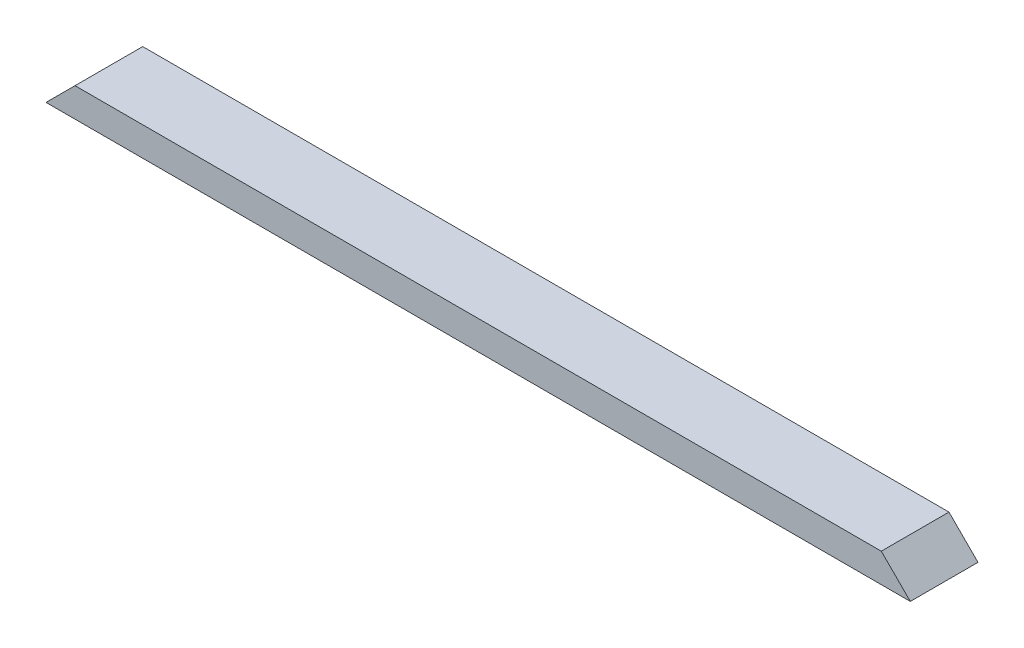
ISO-10303-21;
HEADER;
FILE_DESCRIPTION(('STEP AP214'),'2;1');
FILE_NAME('part.step','',(''),(''),'','','');
FILE_SCHEMA(('AUTOMOTIVE_DESIGN { 1 0 10303 214 1 1 1 1 }'));
ENDSEC;
DATA;
#1=APPLICATION_CONTEXT('core data for automotive mechanical design processes');
#2=APPLICATION_PROTOCOL_DEFINITION('international standard','automotive_design',2000,#1);
#3=PRODUCT_CONTEXT('',#1,'mechanical');
#4=PRODUCT('Part','Part','',(#3));
#5=PRODUCT_RELATED_PRODUCT_CATEGORY('part','',(#4));
#6=PRODUCT_DEFINITION_FORMATION('','',#4);
#7=PRODUCT_DEFINITION_CONTEXT('part definition',#1,'design');
#8=PRODUCT_DEFINITION('design','',#6,#7);
#9=PRODUCT_DEFINITION_SHAPE('','',#8);
#10=(LENGTH_UNIT() NAMED_UNIT(*) SI_UNIT(.MILLI.,.METRE.));
#11=(NAMED_UNIT(*) PLANE_ANGLE_UNIT() SI_UNIT($,.RADIAN.));
#12=(NAMED_UNIT(*) SI_UNIT($,.STERADIAN.) SOLID_ANGLE_UNIT());
#13=UNCERTAINTY_MEASURE_WITH_UNIT(LENGTH_MEASURE(1.E-05),#10,'distance_accuracy_value','');
#14=(GEOMETRIC_REPRESENTATION_CONTEXT(3) GLOBAL_UNCERTAINTY_ASSIGNED_CONTEXT((#13)) GLOBAL_UNIT_ASSIGNED_CONTEXT((#10,
#11,#12)) REPRESENTATION_CONTEXT('',''));
#15=CARTESIAN_POINT('',(0.,0.,0.));
#16=DIRECTION('',(0.,0.,1.));
#17=DIRECTION('',(1.,0.,0.));
#18=AXIS2_PLACEMENT_3D('',#15,#16,#17);
#19=CARTESIAN_POINT('',(0.,38.1,0.));
#20=DIRECTION('',(0.,0.,-1.));
#21=DIRECTION('',(-1.,0.,0.));
#22=AXIS2_PLACEMENT_3D('',#19,#20,#21);
#23=PLANE('',#22);
#24=DIRECTION('',(1.,0.,0.));
#25=VECTOR('',#24,1.);
#26=CARTESIAN_POINT('',(0.,38.1,0.));
#27=LINE('',#26,#25);
#28=CARTESIAN_POINT('',(38.1,38.1,0.));
#29=VERTEX_POINT('',#28);
#30=CARTESIAN_POINT('',(1096.9371,38.1,0.));
#31=VERTEX_POINT('',#30);
#32=EDGE_CURVE('E50',#29,#31,#27,.T.);
#33=ORIENTED_EDGE('',*,*,#32,.F.);
#34=DIRECTION('',(0.707106781186547,0.707106781186547,0.));
#35=VECTOR('',#34,1.);
#36=CARTESIAN_POINT('',(0.,0.,0.));
#37=LINE('',#36,#35);
#38=CARTESIAN_POINT('',(0.,0.,0.));
#39=VERTEX_POINT('',#38);
#40=EDGE_CURVE('E85',#39,#29,#37,.T.);
#41=ORIENTED_EDGE('',*,*,#40,.F.);
#42=DIRECTION('',(1.,0.,0.));
#43=VECTOR('',#42,1.);
#44=CARTESIAN_POINT('',(0.,0.,0.));
#45=LINE('',#44,#43);
#46=CARTESIAN_POINT('',(1135.0371,0.,0.));
#47=VERTEX_POINT('',#46);
#48=EDGE_CURVE('E91',#39,#47,#45,.T.);
#49=ORIENTED_EDGE('',*,*,#48,.T.);
#50=DIRECTION('',(0.707106781186548,-0.707106781186547,0.));
#51=VECTOR('',#50,1.);
#52=CARTESIAN_POINT('',(1096.9371,38.1,0.));
#53=LINE('',#52,#51);
#54=EDGE_CURVE('E66',#31,#47,#53,.T.);
#55=ORIENTED_EDGE('',*,*,#54,.F.);
#56=EDGE_LOOP('',(#33,#41,#49,#55));
#57=FACE_BOUND('',#56,.T.);
#58=ADVANCED_FACE('F41',(#57),#23,.F.);
#59=CARTESIAN_POINT('',(0.,38.1,-88.9));
#60=DIRECTION('',(0.,0.,1.));
#61=DIRECTION('',(1.,0.,0.));
#62=AXIS2_PLACEMENT_3D('',#59,#60,#61);
#63=PLANE('',#62);
#64=DIRECTION('',(-1.,0.,0.));
#65=VECTOR('',#64,1.);
#66=CARTESIAN_POINT('',(0.,0.,-88.9));
#67=LINE('',#66,#65);
#68=CARTESIAN_POINT('',(1135.0371,0.,-88.9));
#69=VERTEX_POINT('',#68);
#70=CARTESIAN_POINT('',(0.,0.,-88.9));
#71=VERTEX_POINT('',#70);
#72=EDGE_CURVE('E44',#69,#71,#67,.T.);
#73=ORIENTED_EDGE('',*,*,#72,.T.);
#74=DIRECTION('',(0.707106781186547,0.707106781186547,0.));
#75=VECTOR('',#74,1.);
#76=CARTESIAN_POINT('',(0.,0.,-88.9));
#77=LINE('',#76,#75);
#78=CARTESIAN_POINT('',(38.1,38.1,-88.9));
#79=VERTEX_POINT('',#78);
#80=EDGE_CURVE('E58',#71,#79,#77,.T.);
#81=ORIENTED_EDGE('',*,*,#80,.T.);
#82=DIRECTION('',(-1.,0.,0.));
#83=VECTOR('',#82,1.);
#84=CARTESIAN_POINT('',(0.,38.1,-88.9));
#85=LINE('',#84,#83);
#86=CARTESIAN_POINT('',(1096.9371,38.1,-88.9));
#87=VERTEX_POINT('',#86);
#88=EDGE_CURVE('E11',#87,#79,#85,.T.);
#89=ORIENTED_EDGE('',*,*,#88,.F.);
#90=DIRECTION('',(0.707106781186548,-0.707106781186547,0.));
#91=VECTOR('',#90,1.);
#92=CARTESIAN_POINT('',(1096.9371,38.1,-88.9));
#93=LINE('',#92,#91);
#94=EDGE_CURVE('E109',#87,#69,#93,.T.);
#95=ORIENTED_EDGE('',*,*,#94,.T.);
#96=EDGE_LOOP('',(#73,#81,#89,#95));
#97=FACE_BOUND('',#96,.T.);
#98=ADVANCED_FACE('F124',(#97),#63,.F.);
#99=CARTESIAN_POINT('',(0.,38.1,0.));
#100=DIRECTION('',(0.,-1.,0.));
#101=DIRECTION('',(0.,0.,-1.));
#102=AXIS2_PLACEMENT_3D('',#99,#100,#101);
#103=PLANE('',#102);
#104=ORIENTED_EDGE('',*,*,#88,.T.);
#105=DIRECTION('',(0.,0.,1.));
#106=VECTOR('',#105,1.);
#107=CARTESIAN_POINT('',(38.1,38.1,-88.9));
#108=LINE('',#107,#106);
#109=EDGE_CURVE('E92',#79,#29,#108,.T.);
#110=ORIENTED_EDGE('',*,*,#109,.T.);
#111=ORIENTED_EDGE('',*,*,#32,.T.);
#112=DIRECTION('',(0.,0.,1.));
#113=VECTOR('',#112,1.);
#114=CARTESIAN_POINT('',(1096.9371,38.1,-88.9));
#115=LINE('',#114,#113);
#116=EDGE_CURVE('E113',#87,#31,#115,.T.);
#117=ORIENTED_EDGE('',*,*,#116,.F.);
#118=EDGE_LOOP('',(#104,#110,#111,#117));
#119=FACE_BOUND('',#118,.T.);
#120=ADVANCED_FACE('F127',(#119),#103,.F.);
#121=CARTESIAN_POINT('',(0.,0.,0.));
#122=DIRECTION('',(0.,-1.,0.));
#123=DIRECTION('',(0.,0.,-1.));
#124=AXIS2_PLACEMENT_3D('',#121,#122,#123);
#125=PLANE('',#124);
#126=DIRECTION('',(0.,0.,1.));
#127=VECTOR('',#126,1.);
#128=CARTESIAN_POINT('',(0.,0.,0.));
#129=LINE('',#128,#127);
#130=EDGE_CURVE('E82',#71,#39,#129,.T.);
#131=ORIENTED_EDGE('',*,*,#130,.F.);
#132=ORIENTED_EDGE('',*,*,#72,.F.);
#133=DIRECTION('',(0.,0.,-1.));
#134=VECTOR('',#133,1.);
#135=CARTESIAN_POINT('',(1135.0371,0.,0.));
#136=LINE('',#135,#134);
#137=EDGE_CURVE('E101',#47,#69,#136,.T.);
#138=ORIENTED_EDGE('',*,*,#137,.F.);
#139=ORIENTED_EDGE('',*,*,#48,.F.);
#140=EDGE_LOOP('',(#131,#132,#138,#139));
#141=FACE_BOUND('',#140,.T.);
#142=ADVANCED_FACE('F100',(#141),#125,.T.);
#143=CARTESIAN_POINT('',(1096.9371,38.1,-88.9));
#144=DIRECTION('',(-0.707106781186547,-0.707106781186548,0.));
#145=DIRECTION('',(0.707106781186548,-0.707106781186547,0.));
#146=AXIS2_PLACEMENT_3D('',#143,#144,#145);
#147=PLANE('',#146);
#148=ORIENTED_EDGE('',*,*,#54,.T.);
#149=ORIENTED_EDGE('',*,*,#137,.T.);
#150=ORIENTED_EDGE('',*,*,#94,.F.);
#151=ORIENTED_EDGE('',*,*,#116,.T.);
#152=EDGE_LOOP('',(#148,#149,#150,#151));
#153=FACE_BOUND('',#152,.T.);
#154=ADVANCED_FACE('F128',(#153),#147,.F.);
#155=CARTESIAN_POINT('',(0.,0.,-88.9));
#156=DIRECTION('',(0.707106781186547,-0.707106781186547,0.));
#157=DIRECTION('',(0.707106781186548,0.707106781186548,0.));
#158=AXIS2_PLACEMENT_3D('',#155,#156,#157);
#159=PLANE('',#158);
#160=ORIENTED_EDGE('',*,*,#40,.T.);
#161=ORIENTED_EDGE('',*,*,#109,.F.);
#162=ORIENTED_EDGE('',*,*,#80,.F.);
#163=ORIENTED_EDGE('',*,*,#130,.T.);
#164=EDGE_LOOP('',(#160,#161,#162,#163));
#165=FACE_BOUND('',#164,.T.);
#166=ADVANCED_FACE('F84',(#165),#159,.F.);
#167=CLOSED_SHELL('',(#58,#98,#120,#142,#154,#166));
#168=MANIFOLD_SOLID_BREP('B2',#167);
#169=ADVANCED_BREP_SHAPE_REPRESENTATION('',(#18,#168),#14);
#170=SHAPE_DEFINITION_REPRESENTATION(#9,#169);
ENDSEC;
END-ISO-10303-21;
